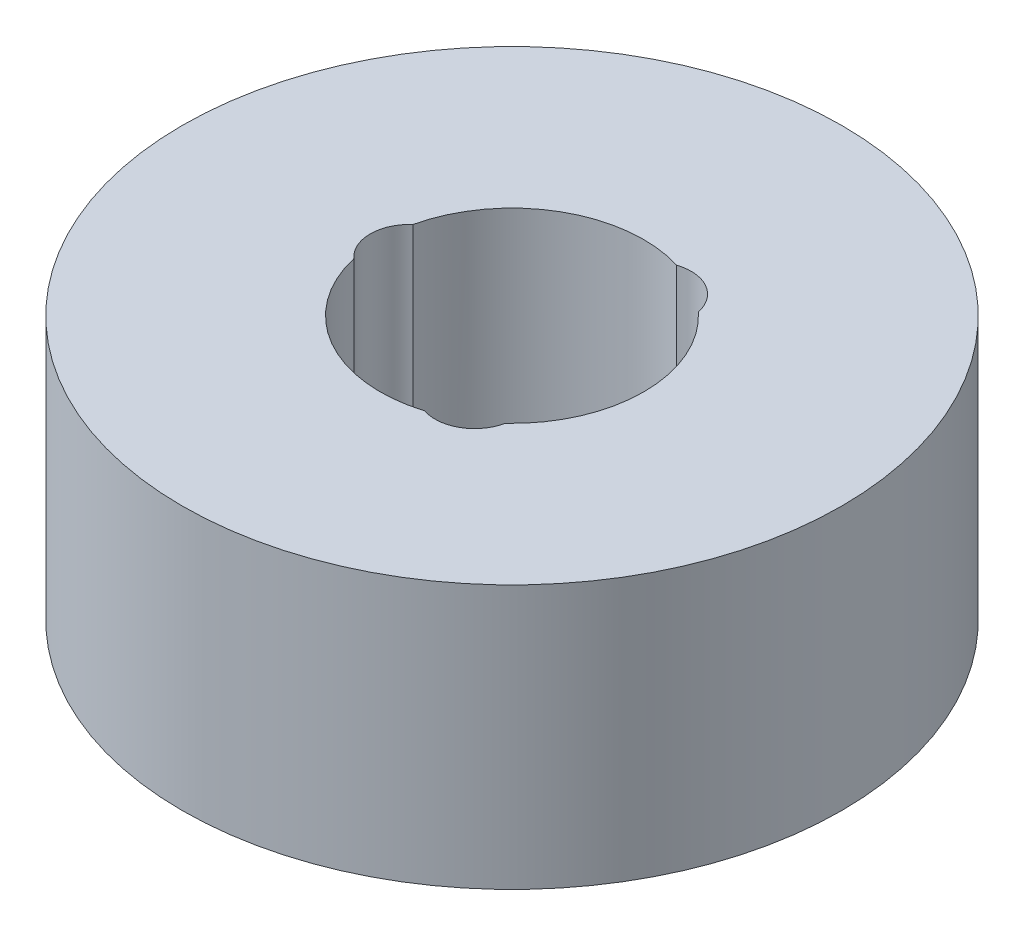
ISO-10303-21;
HEADER;
FILE_DESCRIPTION(('STEP AP214'),'2;1');
FILE_NAME('part.step','',(''),(''),'','','');
FILE_SCHEMA(('AUTOMOTIVE_DESIGN { 1 0 10303 214 1 1 1 1 }'));
ENDSEC;
DATA;
#1=APPLICATION_CONTEXT('core data for automotive mechanical design processes');
#2=APPLICATION_PROTOCOL_DEFINITION('international standard','automotive_design',2000,#1);
#3=PRODUCT_CONTEXT('',#1,'mechanical');
#4=PRODUCT('Part','Part','',(#3));
#5=PRODUCT_RELATED_PRODUCT_CATEGORY('part','',(#4));
#6=PRODUCT_DEFINITION_FORMATION('','',#4);
#7=PRODUCT_DEFINITION_CONTEXT('part definition',#1,'design');
#8=PRODUCT_DEFINITION('design','',#6,#7);
#9=PRODUCT_DEFINITION_SHAPE('','',#8);
#10=(LENGTH_UNIT() NAMED_UNIT(*) SI_UNIT(.MILLI.,.METRE.));
#11=(NAMED_UNIT(*) PLANE_ANGLE_UNIT() SI_UNIT($,.RADIAN.));
#12=(NAMED_UNIT(*) SI_UNIT($,.STERADIAN.) SOLID_ANGLE_UNIT());
#13=UNCERTAINTY_MEASURE_WITH_UNIT(LENGTH_MEASURE(1.E-05),#10,'distance_accuracy_value','');
#14=(GEOMETRIC_REPRESENTATION_CONTEXT(3) GLOBAL_UNCERTAINTY_ASSIGNED_CONTEXT((#13)) GLOBAL_UNIT_ASSIGNED_CONTEXT((#10,
#11,#12)) REPRESENTATION_CONTEXT('',''));
#15=CARTESIAN_POINT('',(0.,0.,0.));
#16=DIRECTION('',(0.,0.,1.));
#17=DIRECTION('',(1.,0.,0.));
#18=AXIS2_PLACEMENT_3D('',#15,#16,#17);
#19=CARTESIAN_POINT('',(0.,10.,0.));
#20=DIRECTION('',(0.,-1.,0.));
#21=DIRECTION('',(0.,0.,-1.));
#22=AXIS2_PLACEMENT_3D('',#19,#20,#21);
#23=CYLINDRICAL_SURFACE('',#22,12.5);
#24=CARTESIAN_POINT('',(0.,10.,0.));
#25=DIRECTION('',(0.,1.,0.));
#26=DIRECTION('',(0.,0.,1.));
#27=AXIS2_PLACEMENT_3D('',#24,#25,#26);
#28=CIRCLE('',#27,12.5);
#29=CARTESIAN_POINT('',(0.,10.,12.5));
#30=VERTEX_POINT('',#29);
#31=EDGE_CURVE('E130',#30,#30,#28,.T.);
#32=ORIENTED_EDGE('',*,*,#31,.F.);
#33=EDGE_LOOP('',(#32));
#34=FACE_BOUND('',#33,.T.);
#35=CARTESIAN_POINT('',(0.,0.,0.));
#36=DIRECTION('',(0.,1.,0.));
#37=DIRECTION('',(0.,0.,1.));
#38=AXIS2_PLACEMENT_3D('',#35,#36,#37);
#39=CIRCLE('',#38,12.5);
#40=CARTESIAN_POINT('',(0.,0.,12.5));
#41=VERTEX_POINT('',#40);
#42=EDGE_CURVE('E117',#41,#41,#39,.T.);
#43=ORIENTED_EDGE('',*,*,#42,.T.);
#44=EDGE_LOOP('',(#43));
#45=FACE_BOUND('',#44,.T.);
#46=ADVANCED_FACE('F39',(#34,#45),#23,.T.);
#47=CARTESIAN_POINT('',(0.,10.,0.));
#48=DIRECTION('',(0.,1.,0.));
#49=DIRECTION('',(0.,0.,1.));
#50=AXIS2_PLACEMENT_3D('',#47,#48,#49);
#51=PLANE('',#50);
#52=CARTESIAN_POINT('',(1.93793686076407,10.,3.35660510470386));
#53=DIRECTION('',(0.,1.,0.));
#54=DIRECTION('',(0.866025403784436,0.,-0.500000000000004));
#55=AXIS2_PLACEMENT_3D('',#52,#53,#54);
#56=CIRCLE('',#55,1.5);
#57=CARTESIAN_POINT('',(1.46572775477114,10.,4.78033912488367));
#58=VERTEX_POINT('',#57);
#59=CARTESIAN_POINT('',(3.40703124346839,10.,3.65952703310554));
#60=VERTEX_POINT('',#59);
#61=EDGE_CURVE('E148',#58,#60,#56,.T.);
#62=ORIENTED_EDGE('',*,*,#61,.F.);
#63=CARTESIAN_POINT('',(0.,10.,0.));
#64=DIRECTION('',(0.,1.,0.));
#65=DIRECTION('',(0.,0.,1.));
#66=AXIS2_PLACEMENT_3D('',#63,#64,#65);
#67=CIRCLE('',#66,5.);
#68=CARTESIAN_POINT('',(-4.87275899823949,10.,1.12081209177812));
#69=VERTEX_POINT('',#68);
#70=EDGE_CURVE('E113',#69,#58,#67,.T.);
#71=ORIENTED_EDGE('',*,*,#70,.F.);
#72=CARTESIAN_POINT('',(-3.8758737215281,10.,0.));
#73=DIRECTION('',(0.,1.,0.));
#74=DIRECTION('',(0.,0.,1.));
#75=AXIS2_PLACEMENT_3D('',#72,#73,#74);
#76=CIRCLE('',#75,1.5);
#77=CARTESIAN_POINT('',(-4.87275899823949,10.,-1.12081209177812));
#78=VERTEX_POINT('',#77);
#79=EDGE_CURVE('E125',#78,#69,#76,.T.);
#80=ORIENTED_EDGE('',*,*,#79,.F.);
#81=CARTESIAN_POINT('',(1.46572775477107,10.,-4.78033912488369));
#82=VERTEX_POINT('',#81);
#83=EDGE_CURVE('E107',#82,#78,#67,.T.);
#84=ORIENTED_EDGE('',*,*,#83,.F.);
#85=CARTESIAN_POINT('',(1.93793686076402,10.,-3.35660510470389));
#86=DIRECTION('',(0.,1.,0.));
#87=DIRECTION('',(-0.866025403784443,0.,-0.499999999999992));
#88=AXIS2_PLACEMENT_3D('',#85,#86,#87);
#89=CIRCLE('',#88,1.5);
#90=CARTESIAN_POINT('',(3.40703124346834,10.,-3.65952703310558));
#91=VERTEX_POINT('',#90);
#92=EDGE_CURVE('E95',#91,#82,#89,.T.);
#93=ORIENTED_EDGE('',*,*,#92,.F.);
#94=EDGE_CURVE('E106',#60,#91,#67,.T.);
#95=ORIENTED_EDGE('',*,*,#94,.F.);
#96=EDGE_LOOP('',(#62,#71,#80,#84,#93,#95));
#97=FACE_BOUND('',#96,.T.);
#98=ORIENTED_EDGE('',*,*,#31,.T.);
#99=EDGE_LOOP('',(#98));
#100=FACE_BOUND('',#99,.T.);
#101=ADVANCED_FACE('F102',(#97,#100),#51,.T.);
#102=CARTESIAN_POINT('',(0.,0.,0.));
#103=DIRECTION('',(0.,1.,0.));
#104=DIRECTION('',(0.,0.,1.));
#105=AXIS2_PLACEMENT_3D('',#102,#103,#104);
#106=PLANE('',#105);
#107=CARTESIAN_POINT('',(0.,0.,0.));
#108=DIRECTION('',(0.,1.,0.));
#109=DIRECTION('',(0.,0.,1.));
#110=AXIS2_PLACEMENT_3D('',#107,#108,#109);
#111=CIRCLE('',#110,5.);
#112=CARTESIAN_POINT('',(0.,0.,5.));
#113=VERTEX_POINT('',#112);
#114=EDGE_CURVE('E118',#113,#113,#111,.T.);
#115=ORIENTED_EDGE('',*,*,#114,.T.);
#116=EDGE_LOOP('',(#115));
#117=FACE_BOUND('',#116,.T.);
#118=ORIENTED_EDGE('',*,*,#42,.F.);
#119=EDGE_LOOP('',(#118));
#120=FACE_BOUND('',#119,.T.);
#121=ADVANCED_FACE('F161',(#117,#120),#106,.F.);
#122=CARTESIAN_POINT('',(0.,10.,0.));
#123=DIRECTION('',(0.,-1.,0.));
#124=DIRECTION('',(0.,0.,-1.));
#125=AXIS2_PLACEMENT_3D('',#122,#123,#124);
#126=CYLINDRICAL_SURFACE('',#125,5.);
#127=DIRECTION('',(0.,1.,0.));
#128=VECTOR('',#127,1.);
#129=CARTESIAN_POINT('',(1.46572775477114,5.77924713794611,4.78033912488367));
#130=LINE('',#129,#128);
#131=CARTESIAN_POINT('',(1.46572775477114,1.55849427589222,4.78033912488367));
#132=VERTEX_POINT('',#131);
#133=EDGE_CURVE('E11',#132,#58,#130,.T.);
#134=ORIENTED_EDGE('',*,*,#133,.F.);
#135=CARTESIAN_POINT('',(0.,1.55849427589222,0.));
#136=DIRECTION('',(0.,1.,0.));
#137=DIRECTION('',(0.,0.,1.));
#138=AXIS2_PLACEMENT_3D('',#135,#136,#137);
#139=CIRCLE('',#138,5.);
#140=CARTESIAN_POINT('',(3.40703124346839,1.55849427589222,3.65952703310554));
#141=VERTEX_POINT('',#140);
#142=EDGE_CURVE('E100',#132,#141,#139,.T.);
#143=ORIENTED_EDGE('',*,*,#142,.T.);
#144=DIRECTION('',(0.,1.,0.));
#145=VECTOR('',#144,1.);
#146=CARTESIAN_POINT('',(3.40703124346839,5.77924713794611,3.65952703310554));
#147=LINE('',#146,#145);
#148=EDGE_CURVE('E46',#60,#141,#147,.F.);
#149=ORIENTED_EDGE('',*,*,#148,.F.);
#150=ORIENTED_EDGE('',*,*,#94,.T.);
#151=DIRECTION('',(0.,1.,0.));
#152=VECTOR('',#151,1.);
#153=CARTESIAN_POINT('',(3.40703124346834,5.77924713794611,-3.65952703310558));
#154=LINE('',#153,#152);
#155=CARTESIAN_POINT('',(3.40703124346834,1.55849427589222,-3.65952703310558));
#156=VERTEX_POINT('',#155);
#157=EDGE_CURVE('E90',#156,#91,#154,.T.);
#158=ORIENTED_EDGE('',*,*,#157,.F.);
#159=CARTESIAN_POINT('',(0.,1.55849427589222,0.));
#160=DIRECTION('',(0.,1.,0.));
#161=DIRECTION('',(0.,0.,1.));
#162=AXIS2_PLACEMENT_3D('',#159,#160,#161);
#163=CIRCLE('',#162,5.);
#164=CARTESIAN_POINT('',(1.46572775477107,1.55849427589222,-4.78033912488369));
#165=VERTEX_POINT('',#164);
#166=EDGE_CURVE('E143',#156,#165,#163,.T.);
#167=ORIENTED_EDGE('',*,*,#166,.T.);
#168=DIRECTION('',(0.,1.,0.));
#169=VECTOR('',#168,1.);
#170=CARTESIAN_POINT('',(1.46572775477107,5.77924713794611,-4.78033912488369));
#171=LINE('',#170,#169);
#172=EDGE_CURVE('E98',#82,#165,#171,.F.);
#173=ORIENTED_EDGE('',*,*,#172,.F.);
#174=ORIENTED_EDGE('',*,*,#83,.T.);
#175=DIRECTION('',(0.,1.,0.));
#176=VECTOR('',#175,1.);
#177=CARTESIAN_POINT('',(-4.87275899823949,5.77924713794611,-1.12081209177812));
#178=LINE('',#177,#176);
#179=CARTESIAN_POINT('',(-4.87275899823949,1.55849427589222,-1.12081209177812));
#180=VERTEX_POINT('',#179);
#181=EDGE_CURVE('E137',#180,#78,#178,.T.);
#182=ORIENTED_EDGE('',*,*,#181,.F.);
#183=CARTESIAN_POINT('',(0.,1.55849427589222,0.));
#184=DIRECTION('',(0.,1.,0.));
#185=DIRECTION('',(0.,0.,1.));
#186=AXIS2_PLACEMENT_3D('',#183,#184,#185);
#187=CIRCLE('',#186,5.);
#188=CARTESIAN_POINT('',(-4.87275899823949,1.55849427589222,1.12081209177812));
#189=VERTEX_POINT('',#188);
#190=EDGE_CURVE('E128',#180,#189,#187,.T.);
#191=ORIENTED_EDGE('',*,*,#190,.T.);
#192=DIRECTION('',(0.,1.,0.));
#193=VECTOR('',#192,1.);
#194=CARTESIAN_POINT('',(-4.87275899823949,5.77924713794611,1.12081209177812));
#195=LINE('',#194,#193);
#196=EDGE_CURVE('E134',#69,#189,#195,.F.);
#197=ORIENTED_EDGE('',*,*,#196,.F.);
#198=ORIENTED_EDGE('',*,*,#70,.T.);
#199=EDGE_LOOP('',(#134,#143,#149,#150,#158,#167,#173,#174,#182,#191,#197,#198));
#200=FACE_BOUND('',#199,.T.);
#201=ORIENTED_EDGE('',*,*,#114,.F.);
#202=EDGE_LOOP('',(#201));
#203=FACE_BOUND('',#202,.T.);
#204=ADVANCED_FACE('F115',(#200,#203),#126,.F.);
#205=CARTESIAN_POINT('',(-3.8758737215281,1.55849427589222,0.));
#206=DIRECTION('',(0.,1.,0.));
#207=DIRECTION('',(0.,0.,1.));
#208=AXIS2_PLACEMENT_3D('',#205,#206,#207);
#209=CYLINDRICAL_SURFACE('',#208,1.5);
#210=ORIENTED_EDGE('',*,*,#181,.T.);
#211=ORIENTED_EDGE('',*,*,#79,.T.);
#212=ORIENTED_EDGE('',*,*,#196,.T.);
#213=CARTESIAN_POINT('',(-3.8758737215281,1.55849427589222,0.));
#214=DIRECTION('',(0.,1.,0.));
#215=DIRECTION('',(0.,0.,1.));
#216=AXIS2_PLACEMENT_3D('',#213,#214,#215);
#217=CIRCLE('',#216,1.5);
#218=EDGE_CURVE('E127',#180,#189,#217,.T.);
#219=ORIENTED_EDGE('',*,*,#218,.F.);
#220=EDGE_LOOP('',(#210,#211,#212,#219));
#221=FACE_BOUND('',#220,.T.);
#222=ADVANCED_FACE('F175',(#221),#209,.F.);
#223=CARTESIAN_POINT('',(-3.8758737215281,1.55849427589222,0.));
#224=DIRECTION('',(0.,1.,0.));
#225=DIRECTION('',(0.,0.,1.));
#226=AXIS2_PLACEMENT_3D('',#223,#224,#225);
#227=PLANE('',#226);
#228=ORIENTED_EDGE('',*,*,#218,.T.);
#229=ORIENTED_EDGE('',*,*,#190,.F.);
#230=EDGE_LOOP('',(#228,#229));
#231=FACE_BOUND('',#230,.T.);
#232=ADVANCED_FACE('F176',(#231),#227,.T.);
#233=CARTESIAN_POINT('',(1.93793686076402,1.55849427589222,-3.35660510470389));
#234=DIRECTION('',(0.,1.,0.));
#235=DIRECTION('',(0.,0.,1.));
#236=AXIS2_PLACEMENT_3D('',#233,#234,#235);
#237=CYLINDRICAL_SURFACE('',#236,1.5);
#238=ORIENTED_EDGE('',*,*,#157,.T.);
#239=ORIENTED_EDGE('',*,*,#92,.T.);
#240=ORIENTED_EDGE('',*,*,#172,.T.);
#241=CARTESIAN_POINT('',(1.93793686076402,1.55849427589222,-3.35660510470389));
#242=DIRECTION('',(0.,1.,0.));
#243=DIRECTION('',(-0.866025403784443,0.,-0.499999999999992));
#244=AXIS2_PLACEMENT_3D('',#241,#242,#243);
#245=CIRCLE('',#244,1.5);
#246=EDGE_CURVE('E56',#156,#165,#245,.T.);
#247=ORIENTED_EDGE('',*,*,#246,.F.);
#248=EDGE_LOOP('',(#238,#239,#240,#247));
#249=FACE_BOUND('',#248,.T.);
#250=ADVANCED_FACE('F93',(#249),#237,.F.);
#251=CARTESIAN_POINT('',(1.93793686076402,1.55849427589222,-3.35660510470389));
#252=DIRECTION('',(0.,1.,0.));
#253=DIRECTION('',(-0.866025403784443,0.,-0.499999999999992));
#254=AXIS2_PLACEMENT_3D('',#251,#252,#253);
#255=PLANE('',#254);
#256=ORIENTED_EDGE('',*,*,#246,.T.);
#257=ORIENTED_EDGE('',*,*,#166,.F.);
#258=EDGE_LOOP('',(#256,#257));
#259=FACE_BOUND('',#258,.T.);
#260=ADVANCED_FACE('F153',(#259),#255,.T.);
#261=CARTESIAN_POINT('',(1.93793686076407,1.55849427589222,3.35660510470386));
#262=DIRECTION('',(0.,1.,0.));
#263=DIRECTION('',(0.,0.,1.));
#264=AXIS2_PLACEMENT_3D('',#261,#262,#263);
#265=CYLINDRICAL_SURFACE('',#264,1.5);
#266=ORIENTED_EDGE('',*,*,#133,.T.);
#267=ORIENTED_EDGE('',*,*,#61,.T.);
#268=ORIENTED_EDGE('',*,*,#148,.T.);
#269=CARTESIAN_POINT('',(1.93793686076407,1.55849427589222,3.35660510470386));
#270=DIRECTION('',(0.,1.,0.));
#271=DIRECTION('',(0.866025403784436,0.,-0.500000000000004));
#272=AXIS2_PLACEMENT_3D('',#269,#270,#271);
#273=CIRCLE('',#272,1.5);
#274=EDGE_CURVE('E55',#132,#141,#273,.T.);
#275=ORIENTED_EDGE('',*,*,#274,.F.);
#276=EDGE_LOOP('',(#266,#267,#268,#275));
#277=FACE_BOUND('',#276,.T.);
#278=ADVANCED_FACE('F144',(#277),#265,.F.);
#279=CARTESIAN_POINT('',(1.93793686076407,1.55849427589222,3.35660510470386));
#280=DIRECTION('',(0.,1.,0.));
#281=DIRECTION('',(0.866025403784436,0.,-0.500000000000004));
#282=AXIS2_PLACEMENT_3D('',#279,#280,#281);
#283=PLANE('',#282);
#284=ORIENTED_EDGE('',*,*,#274,.T.);
#285=ORIENTED_EDGE('',*,*,#142,.F.);
#286=EDGE_LOOP('',(#284,#285));
#287=FACE_BOUND('',#286,.T.);
#288=ADVANCED_FACE('F150',(#287),#283,.T.);
#289=CLOSED_SHELL('',(#46,#101,#121,#204,#222,#232,#250,#260,#278,#288));
#290=MANIFOLD_SOLID_BREP('B2',#289);
#291=ADVANCED_BREP_SHAPE_REPRESENTATION('',(#18,#290),#14);
#292=SHAPE_DEFINITION_REPRESENTATION(#9,#291);
ENDSEC;
END-ISO-10303-21;
